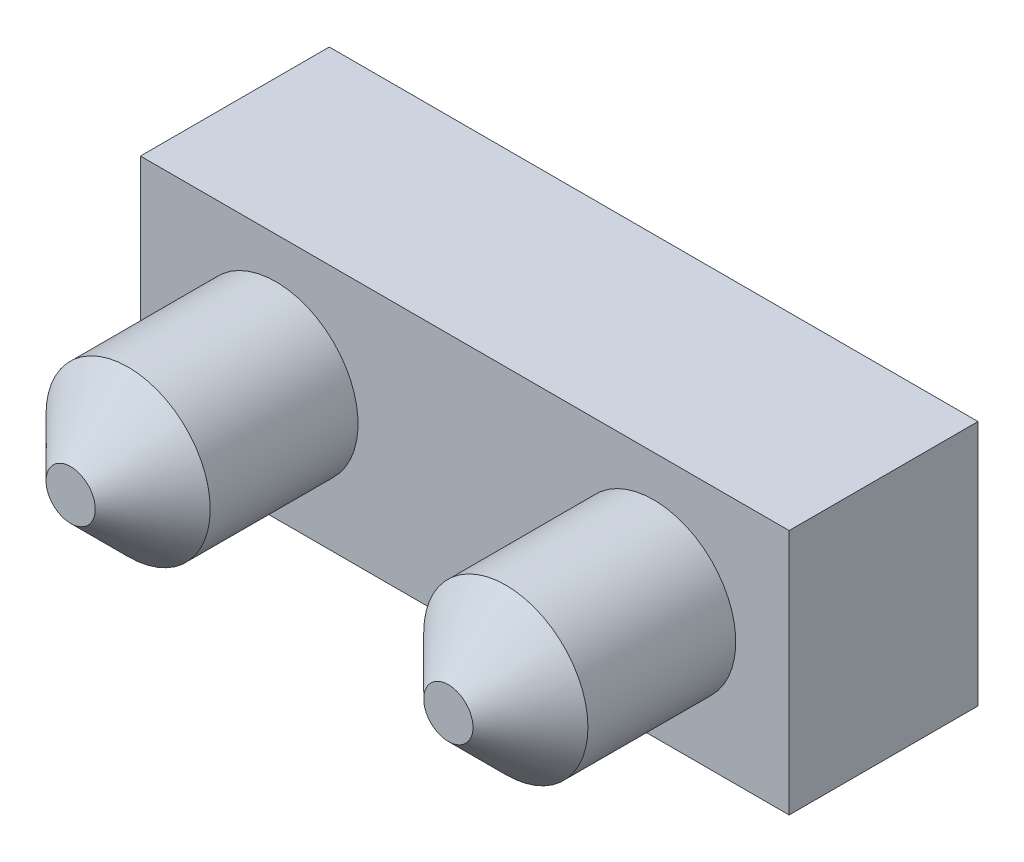
ISO-10303-21;
HEADER;
FILE_DESCRIPTION(('STEP AP214'),'2;1');
FILE_NAME('part.step','',(''),(''),'','','');
FILE_SCHEMA(('AUTOMOTIVE_DESIGN { 1 0 10303 214 1 1 1 1 }'));
ENDSEC;
DATA;
#1=APPLICATION_CONTEXT('core data for automotive mechanical design processes');
#2=APPLICATION_PROTOCOL_DEFINITION('international standard','automotive_design',2000,#1);
#3=PRODUCT_CONTEXT('',#1,'mechanical');
#4=PRODUCT('Part','Part','',(#3));
#5=PRODUCT_RELATED_PRODUCT_CATEGORY('part','',(#4));
#6=PRODUCT_DEFINITION_FORMATION('','',#4);
#7=PRODUCT_DEFINITION_CONTEXT('part definition',#1,'design');
#8=PRODUCT_DEFINITION('design','',#6,#7);
#9=PRODUCT_DEFINITION_SHAPE('','',#8);
#10=(LENGTH_UNIT() NAMED_UNIT(*) SI_UNIT(.MILLI.,.METRE.));
#11=(NAMED_UNIT(*) PLANE_ANGLE_UNIT() SI_UNIT($,.RADIAN.));
#12=(NAMED_UNIT(*) SI_UNIT($,.STERADIAN.) SOLID_ANGLE_UNIT());
#13=UNCERTAINTY_MEASURE_WITH_UNIT(LENGTH_MEASURE(1.E-05),#10,'distance_accuracy_value','');
#14=(GEOMETRIC_REPRESENTATION_CONTEXT(3) GLOBAL_UNCERTAINTY_ASSIGNED_CONTEXT((#13)) GLOBAL_UNIT_ASSIGNED_CONTEXT((#10,
#11,#12)) REPRESENTATION_CONTEXT('',''));
#15=CARTESIAN_POINT('',(0.,0.,0.));
#16=DIRECTION('',(0.,0.,1.));
#17=DIRECTION('',(1.,0.,0.));
#18=AXIS2_PLACEMENT_3D('',#15,#16,#17);
#19=CARTESIAN_POINT('',(-3.95,1.5,2.3));
#20=DIRECTION('',(1.,0.,0.));
#21=DIRECTION('',(0.,1.,0.));
#22=AXIS2_PLACEMENT_3D('',#19,#20,#21);
#23=PLANE('',#22);
#24=DIRECTION('',(0.,-1.,0.));
#25=VECTOR('',#24,1.);
#26=CARTESIAN_POINT('',(-3.95,1.5,0.));
#27=LINE('',#26,#25);
#28=CARTESIAN_POINT('',(-3.95,1.5,0.));
#29=VERTEX_POINT('',#28);
#30=CARTESIAN_POINT('',(-3.95,-1.5,0.));
#31=VERTEX_POINT('',#30);
#32=EDGE_CURVE('E101',#29,#31,#27,.T.);
#33=ORIENTED_EDGE('',*,*,#32,.T.);
#34=DIRECTION('',(0.,0.,-1.));
#35=VECTOR('',#34,1.);
#36=CARTESIAN_POINT('',(-3.95,-1.5,2.3));
#37=LINE('',#36,#35);
#38=CARTESIAN_POINT('',(-3.95,-1.5,2.3));
#39=VERTEX_POINT('',#38);
#40=EDGE_CURVE('E92',#39,#31,#37,.T.);
#41=ORIENTED_EDGE('',*,*,#40,.F.);
#42=DIRECTION('',(0.,-1.,0.));
#43=VECTOR('',#42,1.);
#44=CARTESIAN_POINT('',(-3.95,1.5,2.3));
#45=LINE('',#44,#43);
#46=CARTESIAN_POINT('',(-3.95,1.5,2.3));
#47=VERTEX_POINT('',#46);
#48=EDGE_CURVE('E86',#47,#39,#45,.T.);
#49=ORIENTED_EDGE('',*,*,#48,.F.);
#50=DIRECTION('',(0.,0.,-1.));
#51=VECTOR('',#50,1.);
#52=CARTESIAN_POINT('',(-3.95,1.5,2.3));
#53=LINE('',#52,#51);
#54=EDGE_CURVE('E97',#47,#29,#53,.T.);
#55=ORIENTED_EDGE('',*,*,#54,.T.);
#56=EDGE_LOOP('',(#33,#41,#49,#55));
#57=FACE_BOUND('',#56,.T.);
#58=ADVANCED_FACE('F33',(#57),#23,.F.);
#59=CARTESIAN_POINT('',(3.95,-1.5,2.3));
#60=DIRECTION('',(0.,1.,0.));
#61=DIRECTION('',(-1.,0.,0.));
#62=AXIS2_PLACEMENT_3D('',#59,#60,#61);
#63=PLANE('',#62);
#64=DIRECTION('',(1.,0.,0.));
#65=VECTOR('',#64,1.);
#66=CARTESIAN_POINT('',(3.95,-1.5,0.));
#67=LINE('',#66,#65);
#68=CARTESIAN_POINT('',(3.95,-1.5,0.));
#69=VERTEX_POINT('',#68);
#70=EDGE_CURVE('E91',#31,#69,#67,.T.);
#71=ORIENTED_EDGE('',*,*,#70,.T.);
#72=DIRECTION('',(0.,0.,-1.));
#73=VECTOR('',#72,1.);
#74=CARTESIAN_POINT('',(3.95,-1.5,2.3));
#75=LINE('',#74,#73);
#76=CARTESIAN_POINT('',(3.95,-1.5,2.3));
#77=VERTEX_POINT('',#76);
#78=EDGE_CURVE('E89',#77,#69,#75,.T.);
#79=ORIENTED_EDGE('',*,*,#78,.F.);
#80=DIRECTION('',(1.,0.,0.));
#81=VECTOR('',#80,1.);
#82=CARTESIAN_POINT('',(3.95,-1.5,2.3));
#83=LINE('',#82,#81);
#84=EDGE_CURVE('E81',#39,#77,#83,.T.);
#85=ORIENTED_EDGE('',*,*,#84,.F.);
#86=ORIENTED_EDGE('',*,*,#40,.T.);
#87=EDGE_LOOP('',(#71,#79,#85,#86));
#88=FACE_BOUND('',#87,.T.);
#89=ADVANCED_FACE('F90',(#88),#63,.F.);
#90=CARTESIAN_POINT('',(3.95,1.5,2.3));
#91=DIRECTION('',(-1.,0.,0.));
#92=DIRECTION('',(0.,0.,1.));
#93=AXIS2_PLACEMENT_3D('',#90,#91,#92);
#94=PLANE('',#93);
#95=DIRECTION('',(0.,1.,0.));
#96=VECTOR('',#95,1.);
#97=CARTESIAN_POINT('',(3.95,1.5,0.));
#98=LINE('',#97,#96);
#99=CARTESIAN_POINT('',(3.95,1.5,0.));
#100=VERTEX_POINT('',#99);
#101=EDGE_CURVE('E67',#69,#100,#98,.T.);
#102=ORIENTED_EDGE('',*,*,#101,.T.);
#103=DIRECTION('',(0.,0.,-1.));
#104=VECTOR('',#103,1.);
#105=CARTESIAN_POINT('',(3.95,1.5,2.3));
#106=LINE('',#105,#104);
#107=CARTESIAN_POINT('',(3.95,1.5,2.3));
#108=VERTEX_POINT('',#107);
#109=EDGE_CURVE('E93',#108,#100,#106,.T.);
#110=ORIENTED_EDGE('',*,*,#109,.F.);
#111=DIRECTION('',(0.,1.,0.));
#112=VECTOR('',#111,1.);
#113=CARTESIAN_POINT('',(3.95,1.5,2.3));
#114=LINE('',#113,#112);
#115=EDGE_CURVE('E84',#77,#108,#114,.T.);
#116=ORIENTED_EDGE('',*,*,#115,.F.);
#117=ORIENTED_EDGE('',*,*,#78,.T.);
#118=EDGE_LOOP('',(#102,#110,#116,#117));
#119=FACE_BOUND('',#118,.T.);
#120=ADVANCED_FACE('F95',(#119),#94,.F.);
#121=CARTESIAN_POINT('',(3.95,1.5,2.3));
#122=DIRECTION('',(0.,-1.,0.));
#123=DIRECTION('',(1.,0.,0.));
#124=AXIS2_PLACEMENT_3D('',#121,#122,#123);
#125=PLANE('',#124);
#126=DIRECTION('',(-1.,0.,0.));
#127=VECTOR('',#126,1.);
#128=CARTESIAN_POINT('',(3.95,1.5,0.));
#129=LINE('',#128,#127);
#130=EDGE_CURVE('E73',#100,#29,#129,.T.);
#131=ORIENTED_EDGE('',*,*,#130,.T.);
#132=ORIENTED_EDGE('',*,*,#54,.F.);
#133=DIRECTION('',(-1.,0.,0.));
#134=VECTOR('',#133,1.);
#135=CARTESIAN_POINT('',(3.95,1.5,2.3));
#136=LINE('',#135,#134);
#137=EDGE_CURVE('E50',#108,#47,#136,.T.);
#138=ORIENTED_EDGE('',*,*,#137,.F.);
#139=ORIENTED_EDGE('',*,*,#109,.T.);
#140=EDGE_LOOP('',(#131,#132,#138,#139));
#141=FACE_BOUND('',#140,.T.);
#142=ADVANCED_FACE('F145',(#141),#125,.F.);
#143=CARTESIAN_POINT('',(0.,0.,2.3));
#144=DIRECTION('',(0.,0.,-1.));
#145=DIRECTION('',(-1.,0.,0.));
#146=AXIS2_PLACEMENT_3D('',#143,#144,#145);
#147=PLANE('',#146);
#148=CARTESIAN_POINT('',(2.3,0.,2.3));
#149=DIRECTION('',(0.,0.,-1.));
#150=DIRECTION('',(-1.,0.,0.));
#151=AXIS2_PLACEMENT_3D('',#148,#149,#150);
#152=CIRCLE('',#151,1.);
#153=CARTESIAN_POINT('',(1.3,0.,2.3));
#154=VERTEX_POINT('',#153);
#155=EDGE_CURVE('E113',#154,#154,#152,.F.);
#156=ORIENTED_EDGE('',*,*,#155,.F.);
#157=EDGE_LOOP('',(#156));
#158=FACE_BOUND('',#157,.T.);
#159=CARTESIAN_POINT('',(-2.3,0.,2.3));
#160=DIRECTION('',(0.,0.,-1.));
#161=DIRECTION('',(-1.,0.,0.));
#162=AXIS2_PLACEMENT_3D('',#159,#160,#161);
#163=CIRCLE('',#162,1.);
#164=CARTESIAN_POINT('',(-3.3,0.,2.3));
#165=VERTEX_POINT('',#164);
#166=EDGE_CURVE('E110',#165,#165,#163,.F.);
#167=ORIENTED_EDGE('',*,*,#166,.F.);
#168=EDGE_LOOP('',(#167));
#169=FACE_BOUND('',#168,.T.);
#170=ORIENTED_EDGE('',*,*,#48,.T.);
#171=ORIENTED_EDGE('',*,*,#84,.T.);
#172=ORIENTED_EDGE('',*,*,#115,.T.);
#173=ORIENTED_EDGE('',*,*,#137,.T.);
#174=EDGE_LOOP('',(#170,#171,#172,#173));
#175=FACE_BOUND('',#174,.T.);
#176=ADVANCED_FACE('F82',(#158,#169,#175),#147,.F.);
#177=CARTESIAN_POINT('',(0.,0.,0.));
#178=DIRECTION('',(0.,0.,-1.));
#179=DIRECTION('',(-1.,0.,0.));
#180=AXIS2_PLACEMENT_3D('',#177,#178,#179);
#181=PLANE('',#180);
#182=ORIENTED_EDGE('',*,*,#32,.F.);
#183=ORIENTED_EDGE('',*,*,#130,.F.);
#184=ORIENTED_EDGE('',*,*,#101,.F.);
#185=ORIENTED_EDGE('',*,*,#70,.F.);
#186=EDGE_LOOP('',(#182,#183,#184,#185));
#187=FACE_BOUND('',#186,.T.);
#188=ADVANCED_FACE('F148',(#187),#181,.T.);
#189=CARTESIAN_POINT('',(-2.3,0.,4.8));
#190=DIRECTION('',(0.,0.,-1.));
#191=DIRECTION('',(-1.,0.,0.));
#192=AXIS2_PLACEMENT_3D('',#189,#190,#191);
#193=CYLINDRICAL_SURFACE('',#192,1.);
#194=CARTESIAN_POINT('',(-2.3,0.,4.1));
#195=DIRECTION('',(0.,0.,1.));
#196=DIRECTION('',(1.,0.,0.));
#197=AXIS2_PLACEMENT_3D('',#194,#195,#196);
#198=CIRCLE('',#197,1.);
#199=CARTESIAN_POINT('',(-1.3,0.,4.1));
#200=VERTEX_POINT('',#199);
#201=EDGE_CURVE('E11',#200,#200,#198,.F.);
#202=ORIENTED_EDGE('',*,*,#201,.T.);
#203=EDGE_LOOP('',(#202));
#204=FACE_BOUND('',#203,.T.);
#205=ORIENTED_EDGE('',*,*,#166,.T.);
#206=EDGE_LOOP('',(#205));
#207=FACE_BOUND('',#206,.T.);
#208=ADVANCED_FACE('F151',(#204,#207),#193,.T.);
#209=CARTESIAN_POINT('',(-2.3,0.,4.8));
#210=DIRECTION('',(0.,0.,1.));
#211=DIRECTION('',(1.,0.,0.));
#212=AXIS2_PLACEMENT_3D('',#209,#210,#211);
#213=PLANE('',#212);
#214=CARTESIAN_POINT('',(-2.3,0.,4.8));
#215=DIRECTION('',(0.,0.,1.));
#216=DIRECTION('',(1.,0.,0.));
#217=AXIS2_PLACEMENT_3D('',#214,#215,#216);
#218=CIRCLE('',#217,0.300000000000003);
#219=CARTESIAN_POINT('',(-2.,0.,4.8));
#220=VERTEX_POINT('',#219);
#221=EDGE_CURVE('E42',#220,#220,#218,.T.);
#222=ORIENTED_EDGE('',*,*,#221,.T.);
#223=EDGE_LOOP('',(#222));
#224=FACE_BOUND('',#223,.T.);
#225=ADVANCED_FACE('F124',(#224),#213,.T.);
#226=CARTESIAN_POINT('',(2.3,0.,4.8));
#227=DIRECTION('',(0.,0.,-1.));
#228=DIRECTION('',(-1.,0.,0.));
#229=AXIS2_PLACEMENT_3D('',#226,#227,#228);
#230=CYLINDRICAL_SURFACE('',#229,1.);
#231=CARTESIAN_POINT('',(2.3,0.,4.1));
#232=DIRECTION('',(0.,0.,1.));
#233=DIRECTION('',(1.,0.,0.));
#234=AXIS2_PLACEMENT_3D('',#231,#232,#233);
#235=CIRCLE('',#234,1.);
#236=CARTESIAN_POINT('',(3.3,0.,4.1));
#237=VERTEX_POINT('',#236);
#238=EDGE_CURVE('E119',#237,#237,#235,.F.);
#239=ORIENTED_EDGE('',*,*,#238,.T.);
#240=EDGE_LOOP('',(#239));
#241=FACE_BOUND('',#240,.T.);
#242=ORIENTED_EDGE('',*,*,#155,.T.);
#243=EDGE_LOOP('',(#242));
#244=FACE_BOUND('',#243,.T.);
#245=ADVANCED_FACE('F161',(#241,#244),#230,.T.);
#246=CARTESIAN_POINT('',(2.3,0.,4.8));
#247=DIRECTION('',(0.,0.,1.));
#248=DIRECTION('',(1.,0.,0.));
#249=AXIS2_PLACEMENT_3D('',#246,#247,#248);
#250=PLANE('',#249);
#251=CARTESIAN_POINT('',(2.3,0.,4.8));
#252=DIRECTION('',(0.,0.,1.));
#253=DIRECTION('',(1.,0.,0.));
#254=AXIS2_PLACEMENT_3D('',#251,#252,#253);
#255=CIRCLE('',#254,0.3);
#256=CARTESIAN_POINT('',(2.6,0.,4.8));
#257=VERTEX_POINT('',#256);
#258=EDGE_CURVE('E116',#257,#257,#255,.T.);
#259=ORIENTED_EDGE('',*,*,#258,.T.);
#260=EDGE_LOOP('',(#259));
#261=FACE_BOUND('',#260,.T.);
#262=ADVANCED_FACE('F132',(#261),#250,.T.);
#263=CARTESIAN_POINT('',(2.3,0.,4.8));
#264=DIRECTION('',(0.,0.,-1.));
#265=DIRECTION('',(-1.,0.,0.));
#266=AXIS2_PLACEMENT_3D('',#263,#264,#265);
#267=CONICAL_SURFACE('',#266,0.3,0.785398163397447);
#268=ORIENTED_EDGE('',*,*,#238,.F.);
#269=EDGE_LOOP('',(#268));
#270=FACE_BOUND('',#269,.T.);
#271=ORIENTED_EDGE('',*,*,#258,.F.);
#272=EDGE_LOOP('',(#271));
#273=FACE_BOUND('',#272,.T.);
#274=ADVANCED_FACE('F127',(#270,#273),#267,.T.);
#275=CARTESIAN_POINT('',(-2.3,0.,4.8));
#276=DIRECTION('',(0.,0.,-1.));
#277=DIRECTION('',(-1.,0.,0.));
#278=AXIS2_PLACEMENT_3D('',#275,#276,#277);
#279=CONICAL_SURFACE('',#278,0.300000000000003,0.785398163397446);
#280=ORIENTED_EDGE('',*,*,#201,.F.);
#281=EDGE_LOOP('',(#280));
#282=FACE_BOUND('',#281,.T.);
#283=ORIENTED_EDGE('',*,*,#221,.F.);
#284=EDGE_LOOP('',(#283));
#285=FACE_BOUND('',#284,.T.);
#286=ADVANCED_FACE('F35',(#282,#285),#279,.T.);
#287=CLOSED_SHELL('',(#58,#89,#120,#142,#176,#188,#208,#225,#245,#262,#274,#286));
#288=MANIFOLD_SOLID_BREP('B2',#287);
#289=ADVANCED_BREP_SHAPE_REPRESENTATION('',(#18,#288),#14);
#290=SHAPE_DEFINITION_REPRESENTATION(#9,#289);
ENDSEC;
END-ISO-10303-21;
